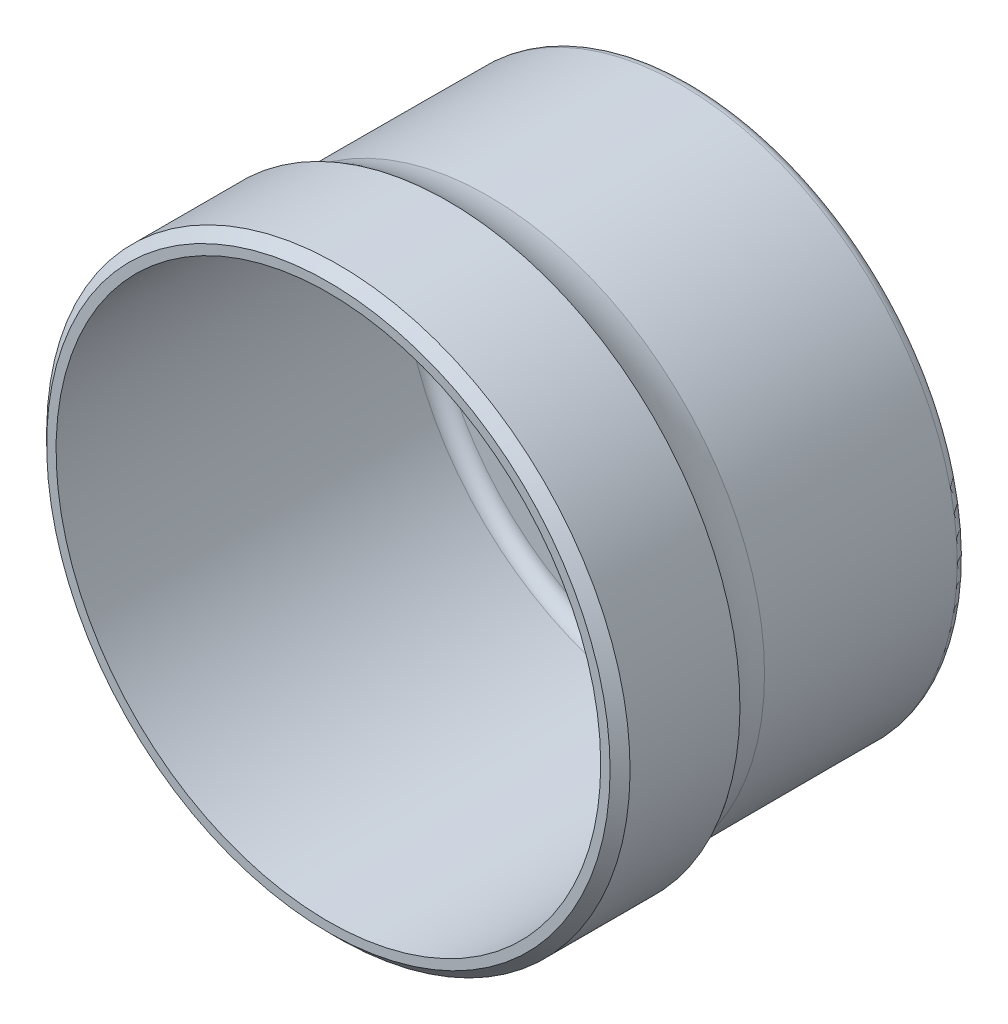
ISO-10303-21;
HEADER;
FILE_DESCRIPTION(('STEP AP214'),'2;1');
FILE_NAME('part.step','',(''),(''),'','','');
FILE_SCHEMA(('AUTOMOTIVE_DESIGN { 1 0 10303 214 1 1 1 1 }'));
ENDSEC;
DATA;
#1=APPLICATION_CONTEXT('core data for automotive mechanical design processes');
#2=APPLICATION_PROTOCOL_DEFINITION('international standard','automotive_design',2000,#1);
#3=PRODUCT_CONTEXT('',#1,'mechanical');
#4=PRODUCT('Part','Part','',(#3));
#5=PRODUCT_RELATED_PRODUCT_CATEGORY('part','',(#4));
#6=PRODUCT_DEFINITION_FORMATION('','',#4);
#7=PRODUCT_DEFINITION_CONTEXT('part definition',#1,'design');
#8=PRODUCT_DEFINITION('design','',#6,#7);
#9=PRODUCT_DEFINITION_SHAPE('','',#8);
#10=(LENGTH_UNIT() NAMED_UNIT(*) SI_UNIT(.MILLI.,.METRE.));
#11=(NAMED_UNIT(*) PLANE_ANGLE_UNIT() SI_UNIT($,.RADIAN.));
#12=(NAMED_UNIT(*) SI_UNIT($,.STERADIAN.) SOLID_ANGLE_UNIT());
#13=UNCERTAINTY_MEASURE_WITH_UNIT(LENGTH_MEASURE(1.E-05),#10,'distance_accuracy_value','');
#14=(GEOMETRIC_REPRESENTATION_CONTEXT(3) GLOBAL_UNCERTAINTY_ASSIGNED_CONTEXT((#13)) GLOBAL_UNIT_ASSIGNED_CONTEXT((#10,
#11,#12)) REPRESENTATION_CONTEXT('',''));
#15=CARTESIAN_POINT('',(0.,0.,0.));
#16=DIRECTION('',(0.,0.,1.));
#17=DIRECTION('',(1.,0.,0.));
#18=AXIS2_PLACEMENT_3D('',#15,#16,#17);
#19=CARTESIAN_POINT('',(-1.5,-2.59807621135332,-16.35));
#20=DIRECTION('',(0.,0.,-1.));
#21=DIRECTION('',(-0.866025403784437,0.5,0.));
#22=AXIS2_PLACEMENT_3D('',#19,#20,#21);
#23=PLANE('',#22);
#24=CARTESIAN_POINT('',(-3.,-5.19615242270662,-16.35));
#25=DIRECTION('',(0.,0.,-1.));
#26=DIRECTION('',(0.866025403784437,-0.5,0.));
#27=AXIS2_PLACEMENT_3D('',#24,#25,#26);
#28=CIRCLE('',#27,1.75);
#29=CARTESIAN_POINT('',(-1.48445554337726,-6.07115242270663,-16.35));
#30=VERTEX_POINT('',#29);
#31=EDGE_CURVE('E11',#30,#30,#28,.T.);
#32=ORIENTED_EDGE('',*,*,#31,.T.);
#33=EDGE_LOOP('',(#32));
#34=FACE_BOUND('',#33,.T.);
#35=CARTESIAN_POINT('',(3.,-5.19615242270663,-16.35));
#36=DIRECTION('',(0.,0.,-1.));
#37=DIRECTION('',(0.866025403784437,-0.5,0.));
#38=AXIS2_PLACEMENT_3D('',#35,#36,#37);
#39=CIRCLE('',#38,1.75);
#40=CARTESIAN_POINT('',(4.51554445662276,-6.07115242270664,-16.35));
#41=VERTEX_POINT('',#40);
#42=EDGE_CURVE('E28',#41,#41,#39,.T.);
#43=ORIENTED_EDGE('',*,*,#42,.T.);
#44=EDGE_LOOP('',(#43));
#45=FACE_BOUND('',#44,.T.);
#46=CARTESIAN_POINT('',(6.,0.,-16.35));
#47=DIRECTION('',(0.,0.,-1.));
#48=DIRECTION('',(0.866025403784437,-0.5,0.));
#49=AXIS2_PLACEMENT_3D('',#46,#47,#48);
#50=CIRCLE('',#49,1.75);
#51=CARTESIAN_POINT('',(7.51554445662276,-0.875000000000013,-16.35));
#52=VERTEX_POINT('',#51);
#53=EDGE_CURVE('E212',#52,#52,#50,.T.);
#54=ORIENTED_EDGE('',*,*,#53,.T.);
#55=EDGE_LOOP('',(#54));
#56=FACE_BOUND('',#55,.T.);
#57=CARTESIAN_POINT('',(3.,5.19615242270663,-16.35));
#58=DIRECTION('',(0.,0.,-1.));
#59=DIRECTION('',(0.866025403784437,-0.5,0.));
#60=AXIS2_PLACEMENT_3D('',#57,#58,#59);
#61=CIRCLE('',#60,1.75);
#62=CARTESIAN_POINT('',(4.51554445662277,4.32115242270662,-16.35));
#63=VERTEX_POINT('',#62);
#64=EDGE_CURVE('E209',#63,#63,#61,.T.);
#65=ORIENTED_EDGE('',*,*,#64,.T.);
#66=EDGE_LOOP('',(#65));
#67=FACE_BOUND('',#66,.T.);
#68=CARTESIAN_POINT('',(-3.,5.19615242270664,-16.35));
#69=DIRECTION('',(0.,0.,-1.));
#70=DIRECTION('',(0.866025403784437,-0.5,0.));
#71=AXIS2_PLACEMENT_3D('',#68,#69,#70);
#72=CIRCLE('',#71,1.75);
#73=CARTESIAN_POINT('',(-1.48445554337723,4.32115242270663,-16.35));
#74=VERTEX_POINT('',#73);
#75=EDGE_CURVE('E205',#74,#74,#72,.T.);
#76=ORIENTED_EDGE('',*,*,#75,.T.);
#77=EDGE_LOOP('',(#76));
#78=FACE_BOUND('',#77,.T.);
#79=CARTESIAN_POINT('',(-6.,0.,-16.35));
#80=DIRECTION('',(0.,0.,-1.));
#81=DIRECTION('',(0.866025403784437,-0.5,0.));
#82=AXIS2_PLACEMENT_3D('',#79,#80,#81);
#83=CIRCLE('',#82,1.75);
#84=CARTESIAN_POINT('',(-4.48445554337724,-0.874999999999988,-16.35));
#85=VERTEX_POINT('',#84);
#86=EDGE_CURVE('E198',#85,#85,#83,.T.);
#87=ORIENTED_EDGE('',*,*,#86,.T.);
#88=EDGE_LOOP('',(#87));
#89=FACE_BOUND('',#88,.T.);
#90=CARTESIAN_POINT('',(0.,0.,-16.35));
#91=DIRECTION('',(0.,0.,-1.));
#92=DIRECTION('',(0.866025403784437,-0.5,0.));
#93=AXIS2_PLACEMENT_3D('',#90,#91,#92);
#94=CIRCLE('',#93,12.93);
#95=CARTESIAN_POINT('',(11.1977084709328,-6.465,-16.35));
#96=VERTEX_POINT('',#95);
#97=EDGE_CURVE('E193',#96,#96,#94,.T.);
#98=ORIENTED_EDGE('',*,*,#97,.F.);
#99=EDGE_LOOP('',(#98));
#100=FACE_BOUND('',#99,.T.);
#101=CARTESIAN_POINT('',(0.,0.,-16.35));
#102=DIRECTION('',(0.,0.,-1.));
#103=DIRECTION('',(0.866025403784437,-0.5,0.));
#104=AXIS2_PLACEMENT_3D('',#101,#102,#103);
#105=CIRCLE('',#104,3.);
#106=CARTESIAN_POINT('',(2.59807621135331,-1.5,-16.35));
#107=VERTEX_POINT('',#106);
#108=EDGE_CURVE('E194',#107,#107,#105,.T.);
#109=ORIENTED_EDGE('',*,*,#108,.T.);
#110=EDGE_LOOP('',(#109));
#111=FACE_BOUND('',#110,.T.);
#112=ADVANCED_FACE('F17',(#34,#45,#56,#67,#78,#89,#100,#111),#23,.F.);
#113=CARTESIAN_POINT('',(0.,0.,-15.65));
#114=DIRECTION('',(0.,0.,-1.));
#115=DIRECTION('',(-0.866025403784437,0.5,0.));
#116=AXIS2_PLACEMENT_3D('',#113,#114,#115);
#117=TOROIDAL_SURFACE('',#116,12.93,0.7);
#118=CARTESIAN_POINT('',(0.,0.,-15.65));
#119=DIRECTION('',(0.,0.,-1.));
#120=DIRECTION('',(0.866025403784437,-0.5,0.));
#121=AXIS2_PLACEMENT_3D('',#118,#119,#120);
#122=CIRCLE('',#121,13.63);
#123=CARTESIAN_POINT('',(11.8039262535819,-6.815,-15.65));
#124=VERTEX_POINT('',#123);
#125=EDGE_CURVE('E189',#124,#124,#122,.T.);
#126=ORIENTED_EDGE('',*,*,#125,.F.);
#127=EDGE_LOOP('',(#126));
#128=FACE_BOUND('',#127,.T.);
#129=ORIENTED_EDGE('',*,*,#97,.T.);
#130=EDGE_LOOP('',(#129));
#131=FACE_BOUND('',#130,.T.);
#132=ADVANCED_FACE('F235',(#128,#131),#117,.F.);
#133=CARTESIAN_POINT('',(0.,0.,-16.35));
#134=DIRECTION('',(0.,0.,-1.));
#135=DIRECTION('',(-0.866025403784437,0.5,0.));
#136=AXIS2_PLACEMENT_3D('',#133,#134,#135);
#137=CYLINDRICAL_SURFACE('',#136,13.63);
#138=CARTESIAN_POINT('',(0.,0.,1.65));
#139=DIRECTION('',(0.,0.,-1.));
#140=DIRECTION('',(0.866025403784437,-0.5,0.));
#141=AXIS2_PLACEMENT_3D('',#138,#139,#140);
#142=CIRCLE('',#141,13.63);
#143=CARTESIAN_POINT('',(11.8039262535819,-6.815,1.65));
#144=VERTEX_POINT('',#143);
#145=EDGE_CURVE('E185',#144,#144,#142,.T.);
#146=ORIENTED_EDGE('',*,*,#145,.F.);
#147=EDGE_LOOP('',(#146));
#148=FACE_BOUND('',#147,.T.);
#149=ORIENTED_EDGE('',*,*,#125,.T.);
#150=EDGE_LOOP('',(#149));
#151=FACE_BOUND('',#150,.T.);
#152=ADVANCED_FACE('F241',(#148,#151),#137,.F.);
#153=CARTESIAN_POINT('',(-6.815,-11.8039262535819,1.65));
#154=DIRECTION('',(0.,0.,-1.));
#155=DIRECTION('',(-0.866025403784437,0.5,0.));
#156=AXIS2_PLACEMENT_3D('',#153,#154,#155);
#157=PLANE('',#156);
#158=CARTESIAN_POINT('',(0.,0.,1.65));
#159=DIRECTION('',(0.,0.,-1.));
#160=DIRECTION('',(0.866025403784437,-0.5,0.));
#161=AXIS2_PLACEMENT_3D('',#158,#159,#160);
#162=CIRCLE('',#161,14.1);
#163=CARTESIAN_POINT('',(12.2109581933606,-7.05,1.65));
#164=VERTEX_POINT('',#163);
#165=EDGE_CURVE('E181',#164,#164,#162,.T.);
#166=ORIENTED_EDGE('',*,*,#165,.F.);
#167=EDGE_LOOP('',(#166));
#168=FACE_BOUND('',#167,.T.);
#169=ORIENTED_EDGE('',*,*,#145,.T.);
#170=EDGE_LOOP('',(#169));
#171=FACE_BOUND('',#170,.T.);
#172=ADVANCED_FACE('F247',(#168,#171),#157,.F.);
#173=CARTESIAN_POINT('',(0.,0.,1.65));
#174=DIRECTION('',(0.,0.,-1.));
#175=DIRECTION('',(-0.866025403784437,0.5,0.));
#176=AXIS2_PLACEMENT_3D('',#173,#174,#175);
#177=CONICAL_SURFACE('',#176,14.1,0.785398163397446);
#178=CARTESIAN_POINT('',(0.,0.,1.15));
#179=DIRECTION('',(0.,0.,-1.));
#180=DIRECTION('',(0.866025403784437,-0.5,0.));
#181=AXIS2_PLACEMENT_3D('',#178,#179,#180);
#182=CIRCLE('',#181,14.6);
#183=CARTESIAN_POINT('',(12.6439708952528,-7.3,1.15));
#184=VERTEX_POINT('',#183);
#185=EDGE_CURVE('E177',#184,#184,#182,.T.);
#186=ORIENTED_EDGE('',*,*,#185,.F.);
#187=EDGE_LOOP('',(#186));
#188=FACE_BOUND('',#187,.T.);
#189=ORIENTED_EDGE('',*,*,#165,.T.);
#190=EDGE_LOOP('',(#189));
#191=FACE_BOUND('',#190,.T.);
#192=ADVANCED_FACE('F251',(#188,#191),#177,.T.);
#193=CARTESIAN_POINT('',(0.,0.,-16.35));
#194=DIRECTION('',(0.,0.,-1.));
#195=DIRECTION('',(-0.866025403784437,0.5,0.));
#196=AXIS2_PLACEMENT_3D('',#193,#194,#195);
#197=CYLINDRICAL_SURFACE('',#196,14.6);
#198=CARTESIAN_POINT('',(0.,0.,-4.35));
#199=DIRECTION('',(0.,0.,-1.));
#200=DIRECTION('',(0.866025403784437,-0.5,0.));
#201=AXIS2_PLACEMENT_3D('',#198,#199,#200);
#202=CIRCLE('',#201,14.6);
#203=CARTESIAN_POINT('',(12.6439708952528,-7.3,-4.35));
#204=VERTEX_POINT('',#203);
#205=EDGE_CURVE('E173',#204,#204,#202,.T.);
#206=ORIENTED_EDGE('',*,*,#205,.F.);
#207=EDGE_LOOP('',(#206));
#208=FACE_BOUND('',#207,.T.);
#209=ORIENTED_EDGE('',*,*,#185,.T.);
#210=EDGE_LOOP('',(#209));
#211=FACE_BOUND('',#210,.T.);
#212=ADVANCED_FACE('F255',(#208,#211),#197,.T.);
#213=CARTESIAN_POINT('',(0.,0.,-7.10471901461298));
#214=DIRECTION('',(0.,0.,-1.));
#215=DIRECTION('',(-0.866025403784437,0.5,0.));
#216=AXIS2_PLACEMENT_3D('',#213,#214,#215);
#217=TOROIDAL_SURFACE('',#216,18.7727117262674,5.);
#218=CARTESIAN_POINT('',(0.,0.,-6.35));
#219=DIRECTION('',(0.,0.,-1.));
#220=DIRECTION('',(0.866025403784437,-0.5,0.));
#221=AXIS2_PLACEMENT_3D('',#218,#219,#220);
#222=CIRCLE('',#221,13.83);
#223=CARTESIAN_POINT('',(11.9771313343388,-6.915,-6.35));
#224=VERTEX_POINT('',#223);
#225=EDGE_CURVE('E169',#224,#224,#222,.T.);
#226=ORIENTED_EDGE('',*,*,#225,.F.);
#227=EDGE_LOOP('',(#226));
#228=FACE_BOUND('',#227,.T.);
#229=ORIENTED_EDGE('',*,*,#205,.T.);
#230=EDGE_LOOP('',(#229));
#231=FACE_BOUND('',#230,.T.);
#232=ADVANCED_FACE('F259',(#228,#231),#217,.F.);
#233=CARTESIAN_POINT('',(0.,0.,-6.35));
#234=DIRECTION('',(0.,0.,1.));
#235=DIRECTION('',(0.866025403784437,-0.5,0.));
#236=AXIS2_PLACEMENT_3D('',#233,#234,#235);
#237=CONICAL_SURFACE('',#236,13.83,0.00199999733334017);
#238=CARTESIAN_POINT('',(0.,0.,-16.0136006296012));
#239=DIRECTION('',(0.,0.,-1.));
#240=DIRECTION('',(0.866025403784437,-0.5,0.));
#241=AXIS2_PLACEMENT_3D('',#238,#239,#240);
#242=CIRCLE('',#241,13.8106727987408);
#243=CARTESIAN_POINT('',(11.9603934870642,-6.90533639937044,-16.0136006296012));
#244=VERTEX_POINT('',#243);
#245=EDGE_CURVE('E165',#244,#244,#242,.T.);
#246=ORIENTED_EDGE('',*,*,#245,.F.);
#247=EDGE_LOOP('',(#246));
#248=FACE_BOUND('',#247,.T.);
#249=ORIENTED_EDGE('',*,*,#225,.T.);
#250=EDGE_LOOP('',(#249));
#251=FACE_BOUND('',#250,.T.);
#252=ADVANCED_FACE('F263',(#248,#251),#237,.T.);
#253=CARTESIAN_POINT('',(0.,0.,-16.0126006316012));
#254=DIRECTION('',(0.,0.,-1.));
#255=DIRECTION('',(-0.866025403784437,0.5,0.));
#256=AXIS2_PLACEMENT_3D('',#253,#254,#255);
#257=TOROIDAL_SURFACE('',#256,13.3106737987378,0.5);
#258=CARTESIAN_POINT('',(0.,0.,-16.5125838358875));
#259=DIRECTION('',(0.,0.,-1.));
#260=DIRECTION('',(0.866025403784437,-0.5,0.));
#261=AXIS2_PLACEMENT_3D('',#258,#259,#260);
#262=CIRCLE('',#261,13.3147720217237);
#263=CARTESIAN_POINT('',(11.530930816411,-6.65738601086189,-16.5125838358875));
#264=VERTEX_POINT('',#263);
#265=EDGE_CURVE('E161',#264,#264,#262,.T.);
#266=ORIENTED_EDGE('',*,*,#265,.F.);
#267=EDGE_LOOP('',(#266));
#268=FACE_BOUND('',#267,.T.);
#269=ORIENTED_EDGE('',*,*,#245,.T.);
#270=EDGE_LOOP('',(#269));
#271=FACE_BOUND('',#270,.T.);
#272=ADVANCED_FACE('F267',(#268,#271),#257,.T.);
#273=CARTESIAN_POINT('',(0.,0.,-16.5125838358875));
#274=DIRECTION('',(0.,0.,1.));
#275=DIRECTION('',(0.866025403784437,-0.5,0.));
#276=AXIS2_PLACEMENT_3D('',#273,#274,#275);
#277=CONICAL_SURFACE('',#276,13.3147720217237,1.56259978904498);
#278=CARTESIAN_POINT('',(0.,0.,-16.55));
#279=DIRECTION('',(0.,0.,-1.));
#280=DIRECTION('',(0.866025403784437,-0.5,0.));
#281=AXIS2_PLACEMENT_3D('',#278,#279,#280);
#282=CIRCLE('',#281,8.75);
#283=CARTESIAN_POINT('',(7.57772228311381,-4.375,-16.55));
#284=VERTEX_POINT('',#283);
#285=EDGE_CURVE('E157',#284,#284,#282,.T.);
#286=ORIENTED_EDGE('',*,*,#285,.F.);
#287=EDGE_LOOP('',(#286));
#288=FACE_BOUND('',#287,.T.);
#289=ORIENTED_EDGE('',*,*,#265,.T.);
#290=EDGE_LOOP('',(#289));
#291=FACE_BOUND('',#290,.T.);
#292=ADVANCED_FACE('F271',(#288,#291),#277,.T.);
#293=CARTESIAN_POINT('',(0.,0.,-16.35));
#294=DIRECTION('',(0.,0.,-1.));
#295=DIRECTION('',(-0.866025403784437,0.5,0.));
#296=AXIS2_PLACEMENT_3D('',#293,#294,#295);
#297=CYLINDRICAL_SURFACE('',#296,8.75);
#298=CARTESIAN_POINT('',(0.,0.,-18.15));
#299=DIRECTION('',(0.,0.,-1.));
#300=DIRECTION('',(0.866025403784437,-0.5,0.));
#301=AXIS2_PLACEMENT_3D('',#298,#299,#300);
#302=CIRCLE('',#301,8.75);
#303=CARTESIAN_POINT('',(7.57772228311381,-4.375,-18.15));
#304=VERTEX_POINT('',#303);
#305=EDGE_CURVE('E153',#304,#304,#302,.T.);
#306=ORIENTED_EDGE('',*,*,#305,.F.);
#307=EDGE_LOOP('',(#306));
#308=FACE_BOUND('',#307,.T.);
#309=ORIENTED_EDGE('',*,*,#285,.T.);
#310=EDGE_LOOP('',(#309));
#311=FACE_BOUND('',#310,.T.);
#312=ADVANCED_FACE('F275',(#308,#311),#297,.T.);
#313=CARTESIAN_POINT('',(0.,0.,-18.15));
#314=DIRECTION('',(0.,0.,1.));
#315=DIRECTION('',(0.866025403784437,-0.5,0.));
#316=AXIS2_PLACEMENT_3D('',#313,#314,#315);
#317=CONICAL_SURFACE('',#316,8.75,0.78539816339745);
#318=CARTESIAN_POINT('',(0.,0.,-18.35));
#319=DIRECTION('',(0.,0.,-1.));
#320=DIRECTION('',(0.866025403784437,-0.5,0.));
#321=AXIS2_PLACEMENT_3D('',#318,#319,#320);
#322=CIRCLE('',#321,8.55);
#323=CARTESIAN_POINT('',(7.40451720235693,-4.275,-18.35));
#324=VERTEX_POINT('',#323);
#325=EDGE_CURVE('E123',#324,#324,#322,.T.);
#326=ORIENTED_EDGE('',*,*,#325,.F.);
#327=EDGE_LOOP('',(#326));
#328=FACE_BOUND('',#327,.T.);
#329=ORIENTED_EDGE('',*,*,#305,.T.);
#330=EDGE_LOOP('',(#329));
#331=FACE_BOUND('',#330,.T.);
#332=ADVANCED_FACE('F279',(#328,#331),#317,.T.);
#333=CARTESIAN_POINT('',(-4.275,-7.40451720235693,-18.35));
#334=DIRECTION('',(0.,0.,1.));
#335=DIRECTION('',(0.866025403784437,-0.5,0.));
#336=AXIS2_PLACEMENT_3D('',#333,#334,#335);
#337=PLANE('',#336);
#338=CARTESIAN_POINT('',(-3.,-5.19615242270662,-18.35));
#339=DIRECTION('',(0.,0.,-1.));
#340=DIRECTION('',(-0.5,-0.866025403784437,0.));
#341=AXIS2_PLACEMENT_3D('',#338,#339,#340);
#342=CIRCLE('',#341,1.75);
#343=CARTESIAN_POINT('',(-3.875,-6.71169687932939,-18.35));
#344=VERTEX_POINT('',#343);
#345=EDGE_CURVE('E146',#344,#344,#342,.T.);
#346=ORIENTED_EDGE('',*,*,#345,.F.);
#347=EDGE_LOOP('',(#346));
#348=FACE_BOUND('',#347,.T.);
#349=CARTESIAN_POINT('',(3.,-5.19615242270663,-18.35));
#350=DIRECTION('',(0.,0.,-1.));
#351=DIRECTION('',(-0.5,-0.866025403784437,0.));
#352=AXIS2_PLACEMENT_3D('',#349,#350,#351);
#353=CIRCLE('',#352,1.75);
#354=CARTESIAN_POINT('',(2.125,-6.7116968793294,-18.35));
#355=VERTEX_POINT('',#354);
#356=EDGE_CURVE('E142',#355,#355,#353,.T.);
#357=ORIENTED_EDGE('',*,*,#356,.F.);
#358=EDGE_LOOP('',(#357));
#359=FACE_BOUND('',#358,.T.);
#360=CARTESIAN_POINT('',(6.,0.,-18.35));
#361=DIRECTION('',(0.,0.,-1.));
#362=DIRECTION('',(-0.5,-0.866025403784437,0.));
#363=AXIS2_PLACEMENT_3D('',#360,#361,#362);
#364=CIRCLE('',#363,1.75);
#365=CARTESIAN_POINT('',(5.125,-1.51554445662278,-18.35));
#366=VERTEX_POINT('',#365);
#367=EDGE_CURVE('E138',#366,#366,#364,.T.);
#368=ORIENTED_EDGE('',*,*,#367,.F.);
#369=EDGE_LOOP('',(#368));
#370=FACE_BOUND('',#369,.T.);
#371=CARTESIAN_POINT('',(3.,5.19615242270663,-18.35));
#372=DIRECTION('',(0.,0.,-1.));
#373=DIRECTION('',(-0.5,-0.866025403784437,0.));
#374=AXIS2_PLACEMENT_3D('',#371,#372,#373);
#375=CIRCLE('',#374,1.75);
#376=CARTESIAN_POINT('',(2.125,3.68060796608387,-18.35));
#377=VERTEX_POINT('',#376);
#378=EDGE_CURVE('E132',#377,#377,#375,.T.);
#379=ORIENTED_EDGE('',*,*,#378,.F.);
#380=EDGE_LOOP('',(#379));
#381=FACE_BOUND('',#380,.T.);
#382=CARTESIAN_POINT('',(-3.,5.19615242270664,-18.35));
#383=DIRECTION('',(0.,0.,-1.));
#384=DIRECTION('',(-0.5,-0.866025403784437,0.));
#385=AXIS2_PLACEMENT_3D('',#382,#383,#384);
#386=CIRCLE('',#385,1.75);
#387=CARTESIAN_POINT('',(-3.875,3.68060796608387,-18.35));
#388=VERTEX_POINT('',#387);
#389=EDGE_CURVE('E125',#388,#388,#386,.T.);
#390=ORIENTED_EDGE('',*,*,#389,.F.);
#391=EDGE_LOOP('',(#390));
#392=FACE_BOUND('',#391,.T.);
#393=CARTESIAN_POINT('',(-6.,0.,-18.35));
#394=DIRECTION('',(0.,0.,-1.));
#395=DIRECTION('',(-0.5,-0.866025403784437,0.));
#396=AXIS2_PLACEMENT_3D('',#393,#394,#395);
#397=CIRCLE('',#396,1.75);
#398=CARTESIAN_POINT('',(-6.875,-1.51554445662274,-18.35));
#399=VERTEX_POINT('',#398);
#400=EDGE_CURVE('E117',#399,#399,#397,.T.);
#401=ORIENTED_EDGE('',*,*,#400,.F.);
#402=EDGE_LOOP('',(#401));
#403=FACE_BOUND('',#402,.T.);
#404=CARTESIAN_POINT('',(0.,0.,-18.35));
#405=DIRECTION('',(0.,0.,-1.));
#406=DIRECTION('',(0.866025403784437,-0.5,0.));
#407=AXIS2_PLACEMENT_3D('',#404,#405,#406);
#408=CIRCLE('',#407,3.3);
#409=CARTESIAN_POINT('',(2.85788383248863,-1.65,-18.35));
#410=VERTEX_POINT('',#409);
#411=EDGE_CURVE('E109',#410,#410,#408,.T.);
#412=ORIENTED_EDGE('',*,*,#411,.F.);
#413=EDGE_LOOP('',(#412));
#414=FACE_BOUND('',#413,.T.);
#415=ORIENTED_EDGE('',*,*,#325,.T.);
#416=EDGE_LOOP('',(#415));
#417=FACE_BOUND('',#416,.T.);
#418=ADVANCED_FACE('F283',(#348,#359,#370,#381,#392,#403,#414,#417),#337,.F.);
#419=CARTESIAN_POINT('',(0.,0.,-18.35));
#420=DIRECTION('',(0.,0.,-1.));
#421=DIRECTION('',(-0.866025403784437,0.5,0.));
#422=AXIS2_PLACEMENT_3D('',#419,#420,#421);
#423=CONICAL_SURFACE('',#422,3.3,0.785398163397445);
#424=CARTESIAN_POINT('',(0.,0.,-18.05));
#425=DIRECTION('',(0.,0.,-1.));
#426=DIRECTION('',(0.866025403784437,-0.5,0.));
#427=AXIS2_PLACEMENT_3D('',#424,#425,#426);
#428=CIRCLE('',#427,3.);
#429=CARTESIAN_POINT('',(2.5980762113533,-1.5,-18.05));
#430=VERTEX_POINT('',#429);
#431=EDGE_CURVE('E21',#430,#430,#428,.T.);
#432=ORIENTED_EDGE('',*,*,#431,.F.);
#433=EDGE_LOOP('',(#432));
#434=FACE_BOUND('',#433,.T.);
#435=ORIENTED_EDGE('',*,*,#411,.T.);
#436=EDGE_LOOP('',(#435));
#437=FACE_BOUND('',#436,.T.);
#438=ADVANCED_FACE('F113',(#434,#437),#423,.F.);
#439=CARTESIAN_POINT('',(0.,0.,-16.35));
#440=DIRECTION('',(0.,0.,-1.));
#441=DIRECTION('',(-0.866025403784437,0.5,0.));
#442=AXIS2_PLACEMENT_3D('',#439,#440,#441);
#443=CYLINDRICAL_SURFACE('',#442,3.);
#444=ORIENTED_EDGE('',*,*,#108,.F.);
#445=EDGE_LOOP('',(#444));
#446=FACE_BOUND('',#445,.T.);
#447=ORIENTED_EDGE('',*,*,#431,.T.);
#448=EDGE_LOOP('',(#447));
#449=FACE_BOUND('',#448,.T.);
#450=ADVANCED_FACE('F290',(#446,#449),#443,.F.);
#451=CARTESIAN_POINT('',(-6.,0.,6.65));
#452=DIRECTION('',(0.,0.,-1.));
#453=DIRECTION('',(-0.866025403784437,0.5,0.));
#454=AXIS2_PLACEMENT_3D('',#451,#452,#453);
#455=CYLINDRICAL_SURFACE('',#454,1.75);
#456=ORIENTED_EDGE('',*,*,#400,.T.);
#457=EDGE_LOOP('',(#456));
#458=FACE_BOUND('',#457,.T.);
#459=ORIENTED_EDGE('',*,*,#86,.F.);
#460=EDGE_LOOP('',(#459));
#461=FACE_BOUND('',#460,.T.);
#462=ADVANCED_FACE('F293',(#458,#461),#455,.F.);
#463=CARTESIAN_POINT('',(-3.,5.19615242270664,6.65));
#464=DIRECTION('',(0.,0.,-1.));
#465=DIRECTION('',(-0.866025403784437,0.5,0.));
#466=AXIS2_PLACEMENT_3D('',#463,#464,#465);
#467=CYLINDRICAL_SURFACE('',#466,1.75);
#468=ORIENTED_EDGE('',*,*,#389,.T.);
#469=EDGE_LOOP('',(#468));
#470=FACE_BOUND('',#469,.T.);
#471=ORIENTED_EDGE('',*,*,#75,.F.);
#472=EDGE_LOOP('',(#471));
#473=FACE_BOUND('',#472,.T.);
#474=ADVANCED_FACE('F297',(#470,#473),#467,.F.);
#475=CARTESIAN_POINT('',(3.,5.19615242270663,6.65));
#476=DIRECTION('',(0.,0.,-1.));
#477=DIRECTION('',(-0.866025403784437,0.5,0.));
#478=AXIS2_PLACEMENT_3D('',#475,#476,#477);
#479=CYLINDRICAL_SURFACE('',#478,1.75);
#480=ORIENTED_EDGE('',*,*,#378,.T.);
#481=EDGE_LOOP('',(#480));
#482=FACE_BOUND('',#481,.T.);
#483=ORIENTED_EDGE('',*,*,#64,.F.);
#484=EDGE_LOOP('',(#483));
#485=FACE_BOUND('',#484,.T.);
#486=ADVANCED_FACE('F231',(#482,#485),#479,.F.);
#487=CARTESIAN_POINT('',(6.,0.,6.65));
#488=DIRECTION('',(0.,0.,-1.));
#489=DIRECTION('',(-0.866025403784437,0.5,0.));
#490=AXIS2_PLACEMENT_3D('',#487,#488,#489);
#491=CYLINDRICAL_SURFACE('',#490,1.75);
#492=ORIENTED_EDGE('',*,*,#367,.T.);
#493=EDGE_LOOP('',(#492));
#494=FACE_BOUND('',#493,.T.);
#495=ORIENTED_EDGE('',*,*,#53,.F.);
#496=EDGE_LOOP('',(#495));
#497=FACE_BOUND('',#496,.T.);
#498=ADVANCED_FACE('F223',(#494,#497),#491,.F.);
#499=CARTESIAN_POINT('',(3.,-5.19615242270663,6.65));
#500=DIRECTION('',(0.,0.,-1.));
#501=DIRECTION('',(-0.866025403784437,0.5,0.));
#502=AXIS2_PLACEMENT_3D('',#499,#500,#501);
#503=CYLINDRICAL_SURFACE('',#502,1.75);
#504=ORIENTED_EDGE('',*,*,#356,.T.);
#505=EDGE_LOOP('',(#504));
#506=FACE_BOUND('',#505,.T.);
#507=ORIENTED_EDGE('',*,*,#42,.F.);
#508=EDGE_LOOP('',(#507));
#509=FACE_BOUND('',#508,.T.);
#510=ADVANCED_FACE('F221',(#506,#509),#503,.F.);
#511=CARTESIAN_POINT('',(-3.,-5.19615242270662,6.65));
#512=DIRECTION('',(0.,0.,-1.));
#513=DIRECTION('',(-0.866025403784437,0.5,0.));
#514=AXIS2_PLACEMENT_3D('',#511,#512,#513);
#515=CYLINDRICAL_SURFACE('',#514,1.75);
#516=ORIENTED_EDGE('',*,*,#345,.T.);
#517=EDGE_LOOP('',(#516));
#518=FACE_BOUND('',#517,.T.);
#519=ORIENTED_EDGE('',*,*,#31,.F.);
#520=EDGE_LOOP('',(#519));
#521=FACE_BOUND('',#520,.T.);
#522=ADVANCED_FACE('F19',(#518,#521),#515,.F.);
#523=CLOSED_SHELL('',(#112,#132,#152,#172,#192,#212,#232,#252,#272,#292,#312,#332,#418,#438,
#450,#462,#474,#486,#498,#510,#522));
#524=MANIFOLD_SOLID_BREP('B1',#523);
#525=ADVANCED_BREP_SHAPE_REPRESENTATION('',(#18,#524),#14);
#526=SHAPE_DEFINITION_REPRESENTATION(#9,#525);
ENDSEC;
END-ISO-10303-21;
